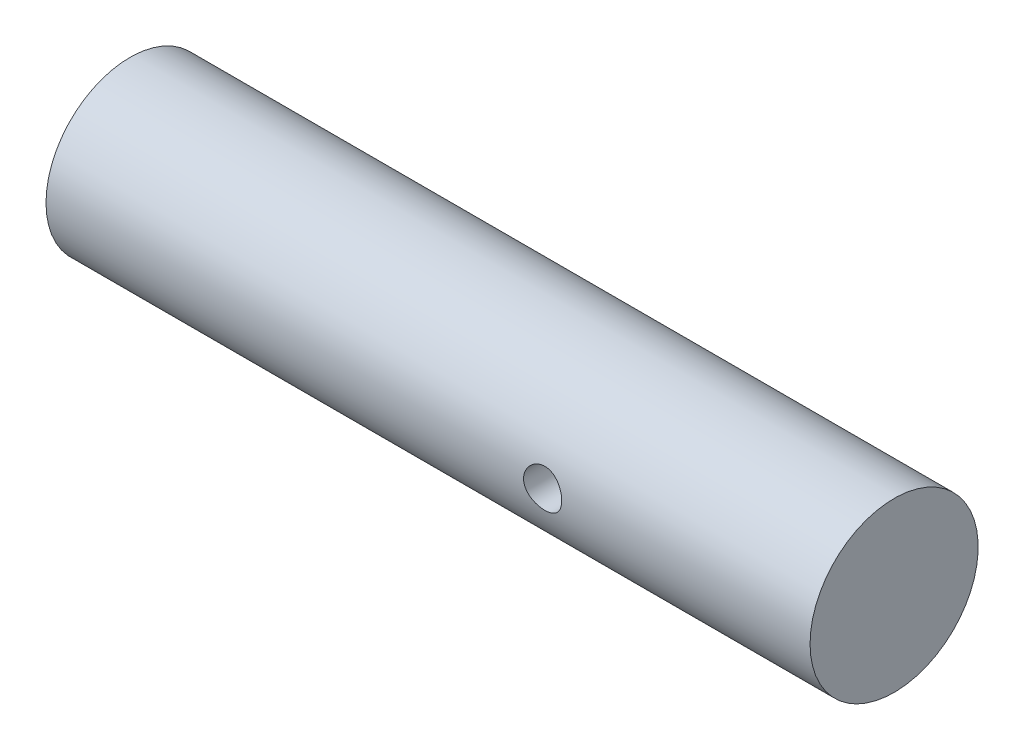
ISO-10303-21;
HEADER;
FILE_DESCRIPTION(('STEP AP214'),'2;1');
FILE_NAME('part.step','',(''),(''),'','','');
FILE_SCHEMA(('AUTOMOTIVE_DESIGN { 1 0 10303 214 1 1 1 1 }'));
ENDSEC;
DATA;
#1=APPLICATION_CONTEXT('core data for automotive mechanical design processes');
#2=APPLICATION_PROTOCOL_DEFINITION('international standard','automotive_design',2000,#1);
#3=PRODUCT_CONTEXT('',#1,'mechanical');
#4=PRODUCT('Part','Part','',(#3));
#5=PRODUCT_RELATED_PRODUCT_CATEGORY('part','',(#4));
#6=PRODUCT_DEFINITION_FORMATION('','',#4);
#7=PRODUCT_DEFINITION_CONTEXT('part definition',#1,'design');
#8=PRODUCT_DEFINITION('design','',#6,#7);
#9=PRODUCT_DEFINITION_SHAPE('','',#8);
#10=(LENGTH_UNIT() NAMED_UNIT(*) SI_UNIT(.MILLI.,.METRE.));
#11=(NAMED_UNIT(*) PLANE_ANGLE_UNIT() SI_UNIT($,.RADIAN.));
#12=(NAMED_UNIT(*) SI_UNIT($,.STERADIAN.) SOLID_ANGLE_UNIT());
#13=UNCERTAINTY_MEASURE_WITH_UNIT(LENGTH_MEASURE(1.E-05),#10,'distance_accuracy_value','');
#14=(GEOMETRIC_REPRESENTATION_CONTEXT(3) GLOBAL_UNCERTAINTY_ASSIGNED_CONTEXT((#13)) GLOBAL_UNIT_ASSIGNED_CONTEXT((#10,
#11,#12)) REPRESENTATION_CONTEXT('',''));
#15=CARTESIAN_POINT('',(0.,0.,0.));
#16=DIRECTION('',(0.,0.,1.));
#17=DIRECTION('',(1.,0.,0.));
#18=AXIS2_PLACEMENT_3D('',#15,#16,#17);
#19=CARTESIAN_POINT('',(0.,0.,0.));
#20=DIRECTION('',(-1.,0.,0.));
#21=DIRECTION('',(0.,0.,1.));
#22=AXIS2_PLACEMENT_3D('',#19,#20,#21);
#23=PLANE('',#22);
#24=CARTESIAN_POINT('',(0.,0.,0.));
#25=DIRECTION('',(-1.,0.,0.));
#26=DIRECTION('',(0.,0.,1.));
#27=AXIS2_PLACEMENT_3D('',#24,#25,#26);
#28=CIRCLE('',#27,11.);
#29=CARTESIAN_POINT('',(0.,0.,11.));
#30=VERTEX_POINT('',#29);
#31=EDGE_CURVE('E55',#30,#30,#28,.T.);
#32=ORIENTED_EDGE('',*,*,#31,.F.);
#33=EDGE_LOOP('',(#32));
#34=FACE_BOUND('',#33,.T.);
#35=ADVANCED_FACE('F38',(#34),#23,.F.);
#36=CARTESIAN_POINT('',(-100.,0.,0.));
#37=DIRECTION('',(-1.,0.,0.));
#38=DIRECTION('',(0.,0.,1.));
#39=AXIS2_PLACEMENT_3D('',#36,#37,#38);
#40=CYLINDRICAL_SURFACE('',#39,11.);
#41=CARTESIAN_POINT('',(-32.5,0.,-11.));
#42=CARTESIAN_POINT('',(-32.5000045318264,0.138518278596904,-10.9999974735185));
#43=CARTESIAN_POINT('',(-32.5115512275769,0.277090172258007,-10.9973570934613));
#44=CARTESIAN_POINT('',(-32.5573794760617,0.550288594599316,-10.987079320306));
#45=CARTESIAN_POINT('',(-32.5916763959553,0.684912392220716,-10.9794385496265));
#46=CARTESIAN_POINT('',(-32.6818680486319,0.946227671984912,-10.9600095312294));
#47=CARTESIAN_POINT('',(-32.7377393279807,1.07292759495648,-10.9482257885674));
#48=CARTESIAN_POINT('',(-32.8694171133808,1.31515227582567,-10.921778201627));
#49=CARTESIAN_POINT('',(-32.9452234208424,1.43067714503182,-10.9071143860399));
#50=CARTESIAN_POINT('',(-33.1160020446067,1.64926760444638,-10.8762265816814));
#51=CARTESIAN_POINT('',(-33.211252573475,1.75211293892051,-10.8599819758326));
#52=CARTESIAN_POINT('',(-33.4176189741372,1.94051389816613,-10.827906511833));
#53=CARTESIAN_POINT('',(-33.5287363506944,2.02606788121784,-10.8120756930933));
#54=CARTESIAN_POINT('',(-33.7653320552837,2.17844599401786,-10.7824158369221));
#55=CARTESIAN_POINT('',(-33.8909669963058,2.24503254356576,-10.7686131580577));
#56=CARTESIAN_POINT('',(-34.1520095005816,2.35606069717871,-10.7448696147509));
#57=CARTESIAN_POINT('',(-34.2874157920616,2.4005051771775,-10.7349282488168));
#58=CARTESIAN_POINT('',(-34.5617591871165,2.46525349412719,-10.7202434469831));
#59=CARTESIAN_POINT('',(-34.7005992631225,2.48594892680756,-10.715415797339));
#60=CARTESIAN_POINT('',(-34.9798582272131,2.50382988451488,-10.7112523406768));
#61=CARTESIAN_POINT('',(-35.1202769026623,2.50101853886553,-10.711915802658));
#62=CARTESIAN_POINT('',(-35.3957728833487,2.47228016958762,-10.7185835035919));
#63=CARTESIAN_POINT('',(-35.5309009061949,2.44681104599438,-10.7244819412976));
#64=CARTESIAN_POINT('',(-35.7949144861548,2.37420684920503,-10.7407873672743));
#65=CARTESIAN_POINT('',(-35.9237996676272,2.32707047404289,-10.7511946264744));
#66=CARTESIAN_POINT('',(-36.1729406718105,2.21205734402545,-10.7754474384537));
#67=CARTESIAN_POINT('',(-36.2931135177637,2.14400712086008,-10.7893215597825));
#68=CARTESIAN_POINT('',(-36.5205025531111,1.98921977920409,-10.8189276843241));
#69=CARTESIAN_POINT('',(-36.6277168402639,1.90247992237135,-10.8346599596346));
#70=CARTESIAN_POINT('',(-36.828778561821,1.71036518003517,-10.8666615287251));
#71=CARTESIAN_POINT('',(-36.9222544265163,1.60460166742828,-10.882934773515));
#72=CARTESIAN_POINT('',(-37.0902058887071,1.37871229840972,-10.9138502597158));
#73=CARTESIAN_POINT('',(-37.1646810866995,1.2585861400908,-10.9284924668293));
#74=CARTESIAN_POINT('',(-37.2926203879715,1.00690799179916,-10.9545497424637));
#75=CARTESIAN_POINT('',(-37.3460327736223,0.875328834348161,-10.9659568484873));
#76=CARTESIAN_POINT('',(-37.4298840058679,0.604745122491708,-10.9841998956698));
#77=CARTESIAN_POINT('',(-37.4603264658222,0.465741739663737,-10.9910365557784));
#78=CARTESIAN_POINT('',(-37.4968262374727,0.187439840192756,-10.9992650071756));
#79=CARTESIAN_POINT('',(-37.5033906913167,0.0482110923370587,-11.0007700184113));
#80=CARTESIAN_POINT('',(-37.4933269601471,-0.229353886680092,-10.9984842255063));
#81=CARTESIAN_POINT('',(-37.476700480594,-0.367690182720854,-10.9946938107912));
#82=CARTESIAN_POINT('',(-37.4211468330946,-0.637841677218451,-10.9823148103742));
#83=CARTESIAN_POINT('',(-37.3824884535562,-0.769715036814407,-10.973784087055));
#84=CARTESIAN_POINT('',(-37.2842689725429,-1.02510393087759,-10.9528806132367));
#85=CARTESIAN_POINT('',(-37.2247059957468,-1.14861871432289,-10.9405075180554));
#86=CARTESIAN_POINT('',(-37.0853308564447,-1.38586085256056,-10.9130143275095));
#87=CARTESIAN_POINT('',(-37.0052243732268,-1.49941068522717,-10.8978552985532));
#88=CARTESIAN_POINT('',(-36.8274206715598,-1.71163773579049,-10.866546095646));
#89=CARTESIAN_POINT('',(-36.7297209734532,-1.81031285357969,-10.8503957821912));
#90=CARTESIAN_POINT('',(-36.5171690348666,-1.99201706218095,-10.8185287714487));
#91=CARTESIAN_POINT('',(-36.4020127582132,-2.0746936659406,-10.8028272119253));
#92=CARTESIAN_POINT('',(-36.1591536093297,-2.21953814406551,-10.7740023321604));
#93=CARTESIAN_POINT('',(-36.0314512920404,-2.28170692501017,-10.7608788979592));
#94=CARTESIAN_POINT('',(-35.7678195304311,-2.38333597241928,-10.7388274870674));
#95=CARTESIAN_POINT('',(-35.6319426762566,-2.42292716221703,-10.7298753781702));
#96=CARTESIAN_POINT('',(-35.3552330933009,-2.47865258340363,-10.7171411058581));
#97=CARTESIAN_POINT('',(-35.2144012348636,-2.49479091341613,-10.7133580391079));
#98=CARTESIAN_POINT('',(-34.9353413806891,-2.50296739214165,-10.7114502943222));
#99=CARTESIAN_POINT('',(-34.7971304006664,-2.4955654850107,-10.7131941458177));
#100=CARTESIAN_POINT('',(-34.5239810898117,-2.45813115403281,-10.7218446846914));
#101=CARTESIAN_POINT('',(-34.3890427138895,-2.42809904217007,-10.7287513008948));
#102=CARTESIAN_POINT('',(-34.1267566026337,-2.34653692360607,-10.7468826027048));
#103=CARTESIAN_POINT('',(-33.9993803088585,-2.29509457527994,-10.758089666867));
#104=CARTESIAN_POINT('',(-33.7549852930994,-2.17224536606879,-10.783564723281));
#105=CARTESIAN_POINT('',(-33.6379677496745,-2.10083623731222,-10.7978330631966));
#106=CARTESIAN_POINT('',(-33.4148655723447,-1.93824996891049,-10.828211072634));
#107=CARTESIAN_POINT('',(-33.3090742777926,-1.84667645642834,-10.8443540558786));
#108=CARTESIAN_POINT('',(-33.114176814918,-1.64715628932417,-10.8764454859305));
#109=CARTESIAN_POINT('',(-33.025074529034,-1.53920583540675,-10.8923938866665));
#110=CARTESIAN_POINT('',(-32.8648619397663,-1.30814060515057,-10.9225693389041));
#111=CARTESIAN_POINT('',(-32.7940261766668,-1.18483162187621,-10.9367686161711));
#112=CARTESIAN_POINT('',(-32.674200029337,-0.927755967711705,-10.9615640551399));
#113=CARTESIAN_POINT('',(-32.6251920052134,-0.793997844337704,-10.9721631246672));
#114=CARTESIAN_POINT('',(-32.5587720938239,-0.55016307153963,-10.9867559512784));
#115=CARTESIAN_POINT('',(-32.5367760123107,-0.441368111138498,-10.9916908558499));
#116=CARTESIAN_POINT('',(-32.5073885264206,-0.221726814930924,-10.9983138080738));
#117=CARTESIAN_POINT('',(-32.4999963723808,-0.110880584717105,-11.0000020223883));
#118=CARTESIAN_POINT('',(-32.5,0.,-11.));
#119=B_SPLINE_CURVE_WITH_KNOTS('',3,(#41,#42,#43,#44,#45,#46,#47,#48,#49,#50,#51,#52,#53,#54,
#55,#56,#57,#58,#59,#60,#61,#62,#63,#64,#65,#66,#67,#68,#69,#70,#71,#72,#73,#74,#75,#76,#77,#78,
#79,#80,#81,#82,#83,#84,#85,#86,#87,#88,#89,#90,#91,#92,#93,#94,#95,#96,#97,#98,#99,#100,#101,
#102,#103,#104,#105,#106,#107,#108,#109,#110,#111,#112,#113,#114,#115,#116,#117,#118),
.UNSPECIFIED.,.T.,.F.,(4,2,2,2,2,2,2,2,2,2,2,2,2,2,2,2,2,2,2,2,2,2,2,2,2,2,2,2,2,2,2,2,2,2,2,2,
2,2,4),(0.,0.415148849633311,0.830578406996923,1.24555761755319,1.66053269430527,
2.0819238939681,2.50335508365802,2.92985362973413,3.35629676538238,3.77560244898084,
4.1948523136876,4.60581714174237,5.01680666753974,5.43130157438852,5.84585725297978,
6.27011531803705,6.69438230269865,7.11968464096648,7.54492006169895,7.96106941916762,
8.37718817463628,8.78833576149037,9.19952024123084,9.61696129328767,10.0344612272567,
10.460313215404,10.8861463755948,11.3094844190899,11.732748471094,12.1460204395146,
12.5592867105954,12.9708773657615,13.382514789318,13.8031102578591,14.2238034502007,
14.6504927745347,15.0768366452215,15.4091704772436,15.74148724914),.UNSPECIFIED.);
#120=CARTESIAN_POINT('',(-32.5,0.,-11.));
#121=VERTEX_POINT('',#120);
#122=EDGE_CURVE('E10',#121,#121,#119,.T.);
#123=ORIENTED_EDGE('',*,*,#122,.T.);
#124=EDGE_LOOP('',(#123));
#125=FACE_BOUND('',#124,.T.);
#126=CARTESIAN_POINT('',(-32.5,0.,11.));
#127=CARTESIAN_POINT('',(-32.5000045318264,-0.138518278596904,10.9999974735185));
#128=CARTESIAN_POINT('',(-32.5115512275769,-0.277090172258006,10.9973570934613));
#129=CARTESIAN_POINT('',(-32.5573794760617,-0.550288594599315,10.987079320306));
#130=CARTESIAN_POINT('',(-32.5916763959553,-0.684912392220717,10.9794385496265));
#131=CARTESIAN_POINT('',(-32.6818680486319,-0.946227671984911,10.9600095312294));
#132=CARTESIAN_POINT('',(-32.7377393279807,-1.07292759495648,10.9482257885674));
#133=CARTESIAN_POINT('',(-32.8694171133809,-1.31515227582567,10.921778201627));
#134=CARTESIAN_POINT('',(-32.9452234208424,-1.43067714503182,10.9071143860399));
#135=CARTESIAN_POINT('',(-33.1160020446067,-1.64926760444637,10.8762265816814));
#136=CARTESIAN_POINT('',(-33.211252573475,-1.75211293892049,10.8599819758326));
#137=CARTESIAN_POINT('',(-33.4176189741372,-1.94051389816611,10.827906511833));
#138=CARTESIAN_POINT('',(-33.5287363506944,-2.02606788121784,10.8120756930933));
#139=CARTESIAN_POINT('',(-33.7653320552837,-2.17844599401786,10.7824158369221));
#140=CARTESIAN_POINT('',(-33.8909669963058,-2.24503254356574,10.7686131580577));
#141=CARTESIAN_POINT('',(-34.1520095005816,-2.35606069717869,10.7448696147508));
#142=CARTESIAN_POINT('',(-34.2874157920616,-2.4005051771775,10.7349282488168));
#143=CARTESIAN_POINT('',(-34.5617591871165,-2.46525349412719,10.7202434469831));
#144=CARTESIAN_POINT('',(-34.7005992631225,-2.48594892680753,10.715415797339));
#145=CARTESIAN_POINT('',(-34.9798582272131,-2.50382988451486,10.7112523406768));
#146=CARTESIAN_POINT('',(-35.1202769026623,-2.50101853886553,10.711915802658));
#147=CARTESIAN_POINT('',(-35.3957728833487,-2.47228016958762,10.7185835035919));
#148=CARTESIAN_POINT('',(-35.5309009061949,-2.44681104599436,10.7244819412976));
#149=CARTESIAN_POINT('',(-35.7949144861548,-2.374206849205,10.7407873672743));
#150=CARTESIAN_POINT('',(-35.9237996676272,-2.32707047404289,10.7511946264744));
#151=CARTESIAN_POINT('',(-36.1729406718105,-2.21205734402545,10.7754474384537));
#152=CARTESIAN_POINT('',(-36.2931135177637,-2.14400712086007,10.7893215597825));
#153=CARTESIAN_POINT('',(-36.520502553111,-1.98921977920406,10.8189276843241));
#154=CARTESIAN_POINT('',(-36.6277168402639,-1.90247992237134,10.8346599596346));
#155=CARTESIAN_POINT('',(-36.828778561821,-1.71036518003517,10.8666615287251));
#156=CARTESIAN_POINT('',(-36.9222544265163,-1.60460166742827,10.882934773515));
#157=CARTESIAN_POINT('',(-37.0902058887071,-1.37871229840973,10.9138502597158));
#158=CARTESIAN_POINT('',(-37.1646810866995,-1.25858614009084,10.9284924668293));
#159=CARTESIAN_POINT('',(-37.2926203879715,-1.0069079917992,10.9545497424637));
#160=CARTESIAN_POINT('',(-37.3460327736223,-0.875328834348183,10.9659568484873));
#161=CARTESIAN_POINT('',(-37.4298840058679,-0.604745122491708,10.9841998956698));
#162=CARTESIAN_POINT('',(-37.4603264658222,-0.465741739663732,10.9910365557784));
#163=CARTESIAN_POINT('',(-37.4968262374727,-0.187439840192745,10.9992650071756));
#164=CARTESIAN_POINT('',(-37.5033906913167,-0.0482110923370483,11.0007700184113));
#165=CARTESIAN_POINT('',(-37.4933269601471,0.229353886680098,10.9984842255063));
#166=CARTESIAN_POINT('',(-37.476700480594,0.367690182720856,10.9946938107912));
#167=CARTESIAN_POINT('',(-37.4211468330946,0.637841677218448,10.9823148103742));
#168=CARTESIAN_POINT('',(-37.3824884535563,0.769715036814404,10.973784087055));
#169=CARTESIAN_POINT('',(-37.2842689725429,1.02510393087758,10.9528806132367));
#170=CARTESIAN_POINT('',(-37.2247059957468,1.14861871432288,10.9405075180554));
#171=CARTESIAN_POINT('',(-37.0853308564447,1.38586085256055,10.9130143275095));
#172=CARTESIAN_POINT('',(-37.0052243732268,1.49941068522718,10.8978552985532));
#173=CARTESIAN_POINT('',(-36.8274206715598,1.71163773579051,10.866546095646));
#174=CARTESIAN_POINT('',(-36.7297209734532,1.8103128535797,10.8503957821912));
#175=CARTESIAN_POINT('',(-36.5171690348666,1.99201706218097,10.8185287714487));
#176=CARTESIAN_POINT('',(-36.4020127582132,2.07469366594062,10.8028272119253));
#177=CARTESIAN_POINT('',(-36.1591536093297,2.21953814406552,10.7740023321604));
#178=CARTESIAN_POINT('',(-36.0314512920404,2.28170692501017,10.7608788979592));
#179=CARTESIAN_POINT('',(-35.7678195304311,2.38333597241928,10.7388274870674));
#180=CARTESIAN_POINT('',(-35.6319426762566,2.42292716221705,10.7298753781702));
#181=CARTESIAN_POINT('',(-35.3552330933009,2.47865258340366,10.7171411058581));
#182=CARTESIAN_POINT('',(-35.2144012348636,2.49479091341616,10.7133580391079));
#183=CARTESIAN_POINT('',(-34.9353413806891,2.50296739214167,10.7114502943222));
#184=CARTESIAN_POINT('',(-34.7971304006664,2.49556548501073,10.7131941458177));
#185=CARTESIAN_POINT('',(-34.5239810898117,2.45813115403284,10.7218446846914));
#186=CARTESIAN_POINT('',(-34.3890427138895,2.4280990421701,10.7287513008948));
#187=CARTESIAN_POINT('',(-34.1267566026337,2.3465369236061,10.7468826027048));
#188=CARTESIAN_POINT('',(-33.9993803088585,2.29509457527996,10.758089666867));
#189=CARTESIAN_POINT('',(-33.7549852930994,2.17224536606882,10.783564723281));
#190=CARTESIAN_POINT('',(-33.6379677496745,2.10083623731225,10.7978330631966));
#191=CARTESIAN_POINT('',(-33.4148655723447,1.93824996891051,10.828211072634));
#192=CARTESIAN_POINT('',(-33.3090742777926,1.84667645642836,10.8443540558786));
#193=CARTESIAN_POINT('',(-33.114176814918,1.64715628932419,10.8764454859305));
#194=CARTESIAN_POINT('',(-33.025074529034,1.53920583540677,10.8923938866665));
#195=CARTESIAN_POINT('',(-32.8648619397663,1.30814060515058,10.9225693389041));
#196=CARTESIAN_POINT('',(-32.7940261766668,1.18483162187622,10.9367686161711));
#197=CARTESIAN_POINT('',(-32.674200029337,0.927755967711713,10.9615640551399));
#198=CARTESIAN_POINT('',(-32.6251920052134,0.793997844337707,10.9721631246672));
#199=CARTESIAN_POINT('',(-32.5587720938239,0.550163071539629,10.9867559512784));
#200=CARTESIAN_POINT('',(-32.5367760123107,0.441368111138498,10.9916908558498));
#201=CARTESIAN_POINT('',(-32.5073885264206,0.221726814930924,10.9983138080737));
#202=CARTESIAN_POINT('',(-32.4999963723808,0.110880584717104,11.0000020223883));
#203=CARTESIAN_POINT('',(-32.5,0.,11.));
#204=B_SPLINE_CURVE_WITH_KNOTS('',3,(#126,#127,#128,#129,#130,#131,#132,#133,#134,#135,#136,
#137,#138,#139,#140,#141,#142,#143,#144,#145,#146,#147,#148,#149,#150,#151,#152,#153,#154,#155,
#156,#157,#158,#159,#160,#161,#162,#163,#164,#165,#166,#167,#168,#169,#170,#171,#172,#173,#174,
#175,#176,#177,#178,#179,#180,#181,#182,#183,#184,#185,#186,#187,#188,#189,#190,#191,#192,#193,
#194,#195,#196,#197,#198,#199,#200,#201,#202,#203),.UNSPECIFIED.,.T.,.F.,(4,2,2,2,2,2,2,2,2,2,2,
2,2,2,2,2,2,2,2,2,2,2,2,2,2,2,2,2,2,2,2,2,2,2,2,2,2,2,4),(0.,0.41514884963331,0.830578406996923,
1.24555761755319,1.66053269430527,2.08192389396808,2.50335508365802,2.92985362973413,
3.35629676538237,3.77560244898082,4.19485231368759,4.60581714174236,5.01680666753972,
5.4313015743885,5.84585725297977,6.27011531803701,6.69438230269859,7.11968464096644,
7.54492006169894,7.9610694191676,8.37718817463625,8.78833576149033,9.1995202412308,
9.61696129328765,10.0344612272567,10.4603132154039,10.8861463755948,11.3094844190899,
11.732748471094,12.1460204395145,12.5592867105954,12.9708773657615,13.382514789318,
13.8031102578591,14.2238034502007,14.6504927745347,15.0768366452216,15.4091704772436,
15.74148724914),.UNSPECIFIED.);
#205=CARTESIAN_POINT('',(-32.5,0.,11.));
#206=VERTEX_POINT('',#205);
#207=EDGE_CURVE('E49',#206,#206,#204,.T.);
#208=ORIENTED_EDGE('',*,*,#207,.T.);
#209=EDGE_LOOP('',(#208));
#210=FACE_BOUND('',#209,.T.);
#211=CARTESIAN_POINT('',(-100.,0.,0.));
#212=DIRECTION('',(-1.,0.,0.));
#213=DIRECTION('',(0.,0.,1.));
#214=AXIS2_PLACEMENT_3D('',#211,#212,#213);
#215=CIRCLE('',#214,11.);
#216=CARTESIAN_POINT('',(-100.,0.,11.));
#217=VERTEX_POINT('',#216);
#218=EDGE_CURVE('E61',#217,#217,#215,.T.);
#219=ORIENTED_EDGE('',*,*,#218,.F.);
#220=EDGE_LOOP('',(#219));
#221=FACE_BOUND('',#220,.T.);
#222=ORIENTED_EDGE('',*,*,#31,.T.);
#223=EDGE_LOOP('',(#222));
#224=FACE_BOUND('',#223,.T.);
#225=ADVANCED_FACE('F67',(#125,#210,#221,#224),#40,.T.);
#226=CARTESIAN_POINT('',(-100.,11.,0.));
#227=DIRECTION('',(1.,0.,0.));
#228=DIRECTION('',(0.,0.,-1.));
#229=AXIS2_PLACEMENT_3D('',#226,#227,#228);
#230=PLANE('',#229);
#231=ORIENTED_EDGE('',*,*,#218,.T.);
#232=EDGE_LOOP('',(#231));
#233=FACE_BOUND('',#232,.T.);
#234=ADVANCED_FACE('F73',(#233),#230,.F.);
#235=CARTESIAN_POINT('',(-35.,0.,-11.));
#236=DIRECTION('',(0.,0.,1.));
#237=DIRECTION('',(1.,0.,0.));
#238=AXIS2_PLACEMENT_3D('',#235,#236,#237);
#239=CYLINDRICAL_SURFACE('',#238,2.5);
#240=ORIENTED_EDGE('',*,*,#207,.F.);
#241=EDGE_LOOP('',(#240));
#242=FACE_BOUND('',#241,.T.);
#243=ORIENTED_EDGE('',*,*,#122,.F.);
#244=EDGE_LOOP('',(#243));
#245=FACE_BOUND('',#244,.T.);
#246=ADVANCED_FACE('F70',(#242,#245),#239,.F.);
#247=CLOSED_SHELL('',(#35,#225,#234,#246));
#248=MANIFOLD_SOLID_BREP('B2',#247);
#249=ADVANCED_BREP_SHAPE_REPRESENTATION('',(#18,#248),#14);
#250=SHAPE_DEFINITION_REPRESENTATION(#9,#249);
ENDSEC;
END-ISO-10303-21;
